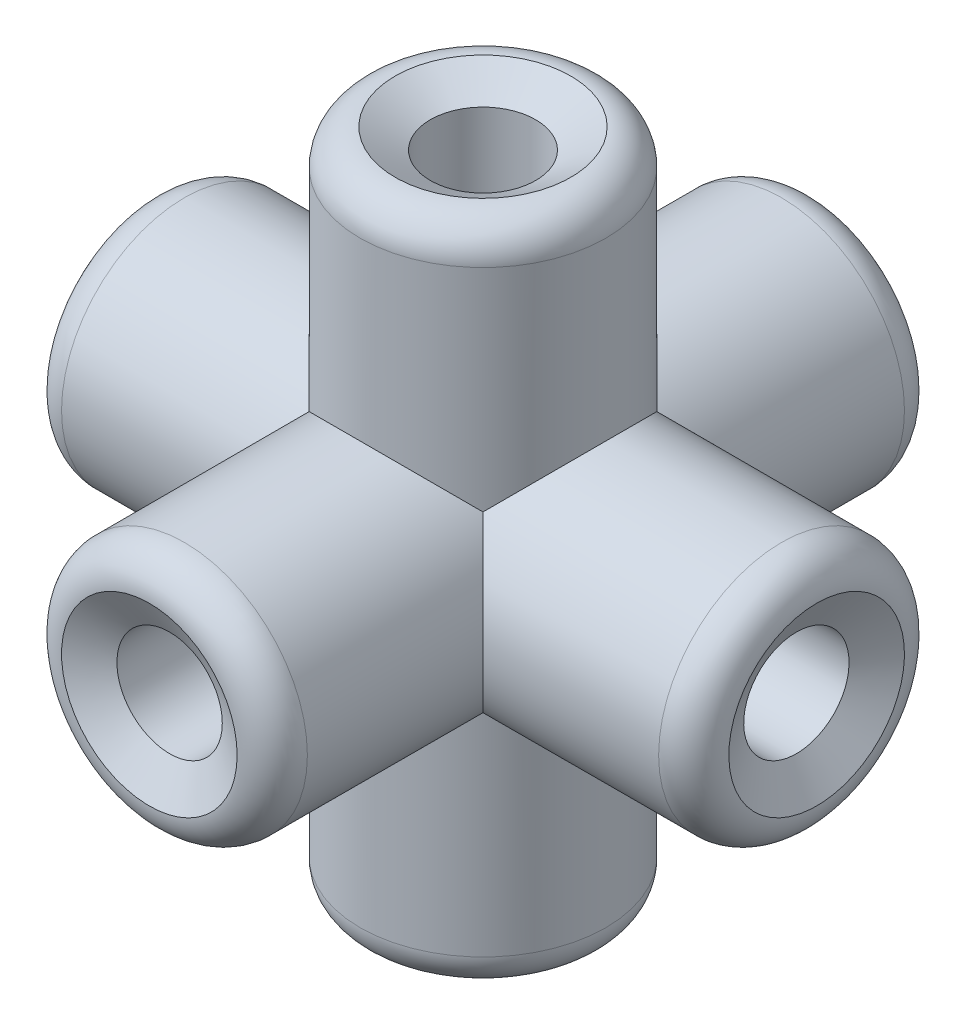
ISO-10303-21;
HEADER;
FILE_DESCRIPTION(('STEP AP214'),'2;1');
FILE_NAME('part.step','',(''),(''),'','','');
FILE_SCHEMA(('AUTOMOTIVE_DESIGN { 1 0 10303 214 1 1 1 1 }'));
ENDSEC;
DATA;
#1=APPLICATION_CONTEXT('core data for automotive mechanical design processes');
#2=APPLICATION_PROTOCOL_DEFINITION('international standard','automotive_design',2000,#1);
#3=PRODUCT_CONTEXT('',#1,'mechanical');
#4=PRODUCT('Part','Part','',(#3));
#5=PRODUCT_RELATED_PRODUCT_CATEGORY('part','',(#4));
#6=PRODUCT_DEFINITION_FORMATION('','',#4);
#7=PRODUCT_DEFINITION_CONTEXT('part definition',#1,'design');
#8=PRODUCT_DEFINITION('design','',#6,#7);
#9=PRODUCT_DEFINITION_SHAPE('','',#8);
#10=(LENGTH_UNIT() NAMED_UNIT(*) SI_UNIT(.MILLI.,.METRE.));
#11=(NAMED_UNIT(*) PLANE_ANGLE_UNIT() SI_UNIT($,.RADIAN.));
#12=(NAMED_UNIT(*) SI_UNIT($,.STERADIAN.) SOLID_ANGLE_UNIT());
#13=UNCERTAINTY_MEASURE_WITH_UNIT(LENGTH_MEASURE(1.E-05),#10,'distance_accuracy_value','');
#14=(GEOMETRIC_REPRESENTATION_CONTEXT(3) GLOBAL_UNCERTAINTY_ASSIGNED_CONTEXT((#13)) GLOBAL_UNIT_ASSIGNED_CONTEXT((#10,
#11,#12)) REPRESENTATION_CONTEXT('',''));
#15=CARTESIAN_POINT('',(0.,0.,0.));
#16=DIRECTION('',(0.,0.,1.));
#17=DIRECTION('',(1.,0.,0.));
#18=AXIS2_PLACEMENT_3D('',#15,#16,#17);
#19=CARTESIAN_POINT('',(0.,0.,-9.21132486540519));
#20=DIRECTION('',(0.,0.,-1.));
#21=DIRECTION('',(-1.,0.,0.));
#22=AXIS2_PLACEMENT_3D('',#19,#20,#21);
#23=CONICAL_SURFACE('',#22,2.,1.0471975511966);
#24=CARTESIAN_POINT('',(0.,0.,-9.5));
#25=DIRECTION('',(0.,0.,1.));
#26=DIRECTION('',(1.,0.,0.));
#27=AXIS2_PLACEMENT_3D('',#24,#25,#26);
#28=CIRCLE('',#27,2.5);
#29=CARTESIAN_POINT('',(2.5,0.,-9.5));
#30=VERTEX_POINT('',#29);
#31=EDGE_CURVE('E11',#30,#30,#28,.T.);
#32=ORIENTED_EDGE('',*,*,#31,.F.);
#33=EDGE_LOOP('',(#32));
#34=FACE_BOUND('',#33,.T.);
#35=CARTESIAN_POINT('',(0.,0.,-8.92264973081037));
#36=DIRECTION('',(0.,0.,1.));
#37=DIRECTION('',(1.,0.,0.));
#38=AXIS2_PLACEMENT_3D('',#35,#36,#37);
#39=CIRCLE('',#38,1.5);
#40=CARTESIAN_POINT('',(1.5,0.,-8.92264973081037));
#41=VERTEX_POINT('',#40);
#42=EDGE_CURVE('E405',#41,#41,#39,.T.);
#43=ORIENTED_EDGE('',*,*,#42,.T.);
#44=EDGE_LOOP('',(#43));
#45=FACE_BOUND('',#44,.T.);
#46=ADVANCED_FACE('F16',(#34,#45),#23,.F.);
#47=CARTESIAN_POINT('',(0.,0.,-8.5));
#48=DIRECTION('',(0.,0.,1.));
#49=DIRECTION('',(1.,0.,0.));
#50=AXIS2_PLACEMENT_3D('',#47,#48,#49);
#51=TOROIDAL_SURFACE('',#50,2.5,1.);
#52=CARTESIAN_POINT('',(0.,0.,-8.5));
#53=DIRECTION('',(0.,0.,1.));
#54=DIRECTION('',(1.,0.,0.));
#55=AXIS2_PLACEMENT_3D('',#52,#53,#54);
#56=CIRCLE('',#55,3.5);
#57=CARTESIAN_POINT('',(3.5,0.,-8.5));
#58=VERTEX_POINT('',#57);
#59=EDGE_CURVE('E234',#58,#58,#56,.T.);
#60=ORIENTED_EDGE('',*,*,#59,.F.);
#61=EDGE_LOOP('',(#60));
#62=FACE_BOUND('',#61,.T.);
#63=ORIENTED_EDGE('',*,*,#31,.T.);
#64=EDGE_LOOP('',(#63));
#65=FACE_BOUND('',#64,.T.);
#66=ADVANCED_FACE('F444',(#62,#65),#51,.T.);
#67=CARTESIAN_POINT('',(0.,0.,3.5));
#68=DIRECTION('',(0.,0.,1.));
#69=DIRECTION('',(1.,0.,0.));
#70=AXIS2_PLACEMENT_3D('',#67,#68,#69);
#71=PLANE('',#70);
#72=CARTESIAN_POINT('',(0.,0.,3.5));
#73=DIRECTION('',(0.,0.,1.));
#74=DIRECTION('',(1.,0.,0.));
#75=AXIS2_PLACEMENT_3D('',#72,#73,#74);
#76=CIRCLE('',#75,1.5);
#77=CARTESIAN_POINT('',(1.5,0.,3.5));
#78=VERTEX_POINT('',#77);
#79=EDGE_CURVE('E27',#78,#78,#76,.T.);
#80=ORIENTED_EDGE('',*,*,#79,.T.);
#81=EDGE_LOOP('',(#80));
#82=FACE_BOUND('',#81,.T.);
#83=ADVANCED_FACE('F450',(#82),#71,.T.);
#84=CARTESIAN_POINT('',(0.,-3.5,0.));
#85=DIRECTION('',(0.,1.,0.));
#86=DIRECTION('',(0.,0.,-1.));
#87=AXIS2_PLACEMENT_3D('',#84,#85,#86);
#88=PLANE('',#87);
#89=CARTESIAN_POINT('',(0.,-3.5,0.));
#90=DIRECTION('',(0.,1.,0.));
#91=DIRECTION('',(-1.,0.,0.));
#92=AXIS2_PLACEMENT_3D('',#89,#90,#91);
#93=CIRCLE('',#92,1.5);
#94=CARTESIAN_POINT('',(-1.5,-3.5,0.));
#95=VERTEX_POINT('',#94);
#96=EDGE_CURVE('E221',#95,#95,#93,.T.);
#97=ORIENTED_EDGE('',*,*,#96,.F.);
#98=EDGE_LOOP('',(#97));
#99=FACE_BOUND('',#98,.T.);
#100=ADVANCED_FACE('F500',(#99),#88,.F.);
#101=CARTESIAN_POINT('',(3.5,0.,0.));
#102=DIRECTION('',(1.,0.,0.));
#103=DIRECTION('',(0.,0.,-1.));
#104=AXIS2_PLACEMENT_3D('',#101,#102,#103);
#105=PLANE('',#104);
#106=CARTESIAN_POINT('',(3.5,0.,0.));
#107=DIRECTION('',(1.,0.,0.));
#108=DIRECTION('',(0.,1.,0.));
#109=AXIS2_PLACEMENT_3D('',#106,#107,#108);
#110=CIRCLE('',#109,1.5);
#111=CARTESIAN_POINT('',(3.5,1.5,0.));
#112=VERTEX_POINT('',#111);
#113=EDGE_CURVE('E297',#112,#112,#110,.T.);
#114=ORIENTED_EDGE('',*,*,#113,.T.);
#115=EDGE_LOOP('',(#114));
#116=FACE_BOUND('',#115,.T.);
#117=ADVANCED_FACE('F503',(#116),#105,.T.);
#118=CARTESIAN_POINT('',(0.,3.5,0.));
#119=DIRECTION('',(0.,1.,0.));
#120=DIRECTION('',(0.,0.,-1.));
#121=AXIS2_PLACEMENT_3D('',#118,#119,#120);
#122=PLANE('',#121);
#123=CARTESIAN_POINT('',(0.,3.5,0.));
#124=DIRECTION('',(0.,1.,0.));
#125=DIRECTION('',(-1.,0.,0.));
#126=AXIS2_PLACEMENT_3D('',#123,#124,#125);
#127=CIRCLE('',#126,1.5);
#128=CARTESIAN_POINT('',(-1.5,3.5,0.));
#129=VERTEX_POINT('',#128);
#130=EDGE_CURVE('E291',#129,#129,#127,.T.);
#131=ORIENTED_EDGE('',*,*,#130,.T.);
#132=EDGE_LOOP('',(#131));
#133=FACE_BOUND('',#132,.T.);
#134=ADVANCED_FACE('F512',(#133),#122,.T.);
#135=CARTESIAN_POINT('',(-3.5,0.,0.));
#136=DIRECTION('',(1.,0.,0.));
#137=DIRECTION('',(0.,0.,1.));
#138=AXIS2_PLACEMENT_3D('',#135,#136,#137);
#139=PLANE('',#138);
#140=CARTESIAN_POINT('',(-3.5,0.,0.));
#141=DIRECTION('',(1.,0.,0.));
#142=DIRECTION('',(0.,1.,0.));
#143=AXIS2_PLACEMENT_3D('',#140,#141,#142);
#144=CIRCLE('',#143,1.5);
#145=CARTESIAN_POINT('',(-3.5,1.5,0.));
#146=VERTEX_POINT('',#145);
#147=EDGE_CURVE('E287',#146,#146,#144,.T.);
#148=ORIENTED_EDGE('',*,*,#147,.F.);
#149=EDGE_LOOP('',(#148));
#150=FACE_BOUND('',#149,.T.);
#151=ADVANCED_FACE('F509',(#150),#139,.F.);
#152=CARTESIAN_POINT('',(0.,0.,3.5));
#153=DIRECTION('',(0.,0.,1.));
#154=DIRECTION('',(1.,0.,0.));
#155=AXIS2_PLACEMENT_3D('',#152,#153,#154);
#156=CYLINDRICAL_SURFACE('',#155,1.5);
#157=CARTESIAN_POINT('',(0.,0.,8.92264973081037));
#158=DIRECTION('',(0.,0.,-1.));
#159=DIRECTION('',(1.,0.,0.));
#160=AXIS2_PLACEMENT_3D('',#157,#158,#159);
#161=CIRCLE('',#160,1.5);
#162=CARTESIAN_POINT('',(1.5,0.,8.92264973081037));
#163=VERTEX_POINT('',#162);
#164=EDGE_CURVE('E257',#163,#163,#161,.T.);
#165=ORIENTED_EDGE('',*,*,#164,.F.);
#166=EDGE_LOOP('',(#165));
#167=FACE_BOUND('',#166,.T.);
#168=ORIENTED_EDGE('',*,*,#79,.F.);
#169=EDGE_LOOP('',(#168));
#170=FACE_BOUND('',#169,.T.);
#171=ADVANCED_FACE('F456',(#167,#170),#156,.F.);
#172=CARTESIAN_POINT('',(0.,-3.5,0.));
#173=DIRECTION('',(0.,1.,0.));
#174=DIRECTION('',(-1.,0.,0.));
#175=AXIS2_PLACEMENT_3D('',#172,#173,#174);
#176=CYLINDRICAL_SURFACE('',#175,1.5);
#177=ORIENTED_EDGE('',*,*,#96,.T.);
#178=EDGE_LOOP('',(#177));
#179=FACE_BOUND('',#178,.T.);
#180=CARTESIAN_POINT('',(0.,-8.92264973081037,0.));
#181=DIRECTION('',(0.,1.,0.));
#182=DIRECTION('',(-1.,0.,0.));
#183=AXIS2_PLACEMENT_3D('',#180,#181,#182);
#184=CIRCLE('',#183,1.5);
#185=CARTESIAN_POINT('',(-1.5,-8.92264973081037,0.));
#186=VERTEX_POINT('',#185);
#187=EDGE_CURVE('E254',#186,#186,#184,.T.);
#188=ORIENTED_EDGE('',*,*,#187,.F.);
#189=EDGE_LOOP('',(#188));
#190=FACE_BOUND('',#189,.T.);
#191=ADVANCED_FACE('F505',(#179,#190),#176,.F.);
#192=CARTESIAN_POINT('',(3.5,0.,0.));
#193=DIRECTION('',(1.,0.,0.));
#194=DIRECTION('',(0.,1.,0.));
#195=AXIS2_PLACEMENT_3D('',#192,#193,#194);
#196=CYLINDRICAL_SURFACE('',#195,1.5);
#197=CARTESIAN_POINT('',(8.92264973081037,0.,0.));
#198=DIRECTION('',(-1.,0.,0.));
#199=DIRECTION('',(0.,1.,0.));
#200=AXIS2_PLACEMENT_3D('',#197,#198,#199);
#201=CIRCLE('',#200,1.5);
#202=CARTESIAN_POINT('',(8.92264973081037,1.5,0.));
#203=VERTEX_POINT('',#202);
#204=EDGE_CURVE('E258',#203,#203,#201,.T.);
#205=ORIENTED_EDGE('',*,*,#204,.F.);
#206=EDGE_LOOP('',(#205));
#207=FACE_BOUND('',#206,.T.);
#208=ORIENTED_EDGE('',*,*,#113,.F.);
#209=EDGE_LOOP('',(#208));
#210=FACE_BOUND('',#209,.T.);
#211=ADVANCED_FACE('F475',(#207,#210),#196,.F.);
#212=CARTESIAN_POINT('',(0.,3.5,0.));
#213=DIRECTION('',(0.,1.,0.));
#214=DIRECTION('',(-1.,0.,0.));
#215=AXIS2_PLACEMENT_3D('',#212,#213,#214);
#216=CYLINDRICAL_SURFACE('',#215,1.5);
#217=CARTESIAN_POINT('',(0.,8.92264973081037,0.));
#218=DIRECTION('',(0.,-1.,0.));
#219=DIRECTION('',(-1.,0.,0.));
#220=AXIS2_PLACEMENT_3D('',#217,#218,#219);
#221=CIRCLE('',#220,1.5);
#222=CARTESIAN_POINT('',(-1.5,8.92264973081037,0.));
#223=VERTEX_POINT('',#222);
#224=EDGE_CURVE('E253',#223,#223,#221,.T.);
#225=ORIENTED_EDGE('',*,*,#224,.F.);
#226=EDGE_LOOP('',(#225));
#227=FACE_BOUND('',#226,.T.);
#228=ORIENTED_EDGE('',*,*,#130,.F.);
#229=EDGE_LOOP('',(#228));
#230=FACE_BOUND('',#229,.T.);
#231=ADVANCED_FACE('F466',(#227,#230),#216,.F.);
#232=CARTESIAN_POINT('',(-3.5,0.,0.));
#233=DIRECTION('',(1.,0.,0.));
#234=DIRECTION('',(0.,1.,0.));
#235=AXIS2_PLACEMENT_3D('',#232,#233,#234);
#236=CYLINDRICAL_SURFACE('',#235,1.5);
#237=ORIENTED_EDGE('',*,*,#147,.T.);
#238=EDGE_LOOP('',(#237));
#239=FACE_BOUND('',#238,.T.);
#240=CARTESIAN_POINT('',(-8.92264973081037,0.,0.));
#241=DIRECTION('',(1.,0.,0.));
#242=DIRECTION('',(0.,1.,0.));
#243=AXIS2_PLACEMENT_3D('',#240,#241,#242);
#244=CIRCLE('',#243,1.5);
#245=CARTESIAN_POINT('',(-8.92264973081037,1.5,0.));
#246=VERTEX_POINT('',#245);
#247=EDGE_CURVE('E241',#246,#246,#244,.T.);
#248=ORIENTED_EDGE('',*,*,#247,.F.);
#249=EDGE_LOOP('',(#248));
#250=FACE_BOUND('',#249,.T.);
#251=ADVANCED_FACE('F463',(#239,#250),#236,.F.);
#252=CARTESIAN_POINT('',(0.,0.,9.21132486540519));
#253=DIRECTION('',(0.,0.,1.));
#254=DIRECTION('',(1.,0.,0.));
#255=AXIS2_PLACEMENT_3D('',#252,#253,#254);
#256=CONICAL_SURFACE('',#255,2.,1.0471975511966);
#257=CARTESIAN_POINT('',(0.,0.,9.5));
#258=DIRECTION('',(0.,0.,1.));
#259=DIRECTION('',(1.,0.,0.));
#260=AXIS2_PLACEMENT_3D('',#257,#258,#259);
#261=CIRCLE('',#260,2.5);
#262=CARTESIAN_POINT('',(2.5,0.,9.5));
#263=VERTEX_POINT('',#262);
#264=EDGE_CURVE('E235',#263,#263,#261,.T.);
#265=ORIENTED_EDGE('',*,*,#264,.T.);
#266=EDGE_LOOP('',(#265));
#267=FACE_BOUND('',#266,.T.);
#268=ORIENTED_EDGE('',*,*,#164,.T.);
#269=EDGE_LOOP('',(#268));
#270=FACE_BOUND('',#269,.T.);
#271=ADVANCED_FACE('F465',(#267,#270),#256,.F.);
#272=CARTESIAN_POINT('',(0.,-9.21132486540519,0.));
#273=DIRECTION('',(0.,-1.,0.));
#274=DIRECTION('',(1.,0.,0.));
#275=AXIS2_PLACEMENT_3D('',#272,#273,#274);
#276=CONICAL_SURFACE('',#275,2.,1.0471975511966);
#277=ORIENTED_EDGE('',*,*,#187,.T.);
#278=EDGE_LOOP('',(#277));
#279=FACE_BOUND('',#278,.T.);
#280=CARTESIAN_POINT('',(0.,-9.5,0.));
#281=DIRECTION('',(0.,1.,0.));
#282=DIRECTION('',(-1.,0.,0.));
#283=AXIS2_PLACEMENT_3D('',#280,#281,#282);
#284=CIRCLE('',#283,2.5);
#285=CARTESIAN_POINT('',(-2.5,-9.5,0.));
#286=VERTEX_POINT('',#285);
#287=EDGE_CURVE('E242',#286,#286,#284,.T.);
#288=ORIENTED_EDGE('',*,*,#287,.F.);
#289=EDGE_LOOP('',(#288));
#290=FACE_BOUND('',#289,.T.);
#291=ADVANCED_FACE('F472',(#279,#290),#276,.F.);
#292=CARTESIAN_POINT('',(9.21132486540519,0.,0.));
#293=DIRECTION('',(1.,0.,0.));
#294=DIRECTION('',(0.,1.,0.));
#295=AXIS2_PLACEMENT_3D('',#292,#293,#294);
#296=CONICAL_SURFACE('',#295,2.,1.0471975511966);
#297=CARTESIAN_POINT('',(9.5,0.,0.));
#298=DIRECTION('',(1.,0.,0.));
#299=DIRECTION('',(0.,1.,0.));
#300=AXIS2_PLACEMENT_3D('',#297,#298,#299);
#301=CIRCLE('',#300,2.5);
#302=CARTESIAN_POINT('',(9.5,2.5,0.));
#303=VERTEX_POINT('',#302);
#304=EDGE_CURVE('E250',#303,#303,#301,.T.);
#305=ORIENTED_EDGE('',*,*,#304,.T.);
#306=EDGE_LOOP('',(#305));
#307=FACE_BOUND('',#306,.T.);
#308=ORIENTED_EDGE('',*,*,#204,.T.);
#309=EDGE_LOOP('',(#308));
#310=FACE_BOUND('',#309,.T.);
#311=ADVANCED_FACE('F416',(#307,#310),#296,.F.);
#312=CARTESIAN_POINT('',(0.,9.21132486540519,0.));
#313=DIRECTION('',(0.,1.,0.));
#314=DIRECTION('',(-1.,0.,0.));
#315=AXIS2_PLACEMENT_3D('',#312,#313,#314);
#316=CONICAL_SURFACE('',#315,2.,1.0471975511966);
#317=ORIENTED_EDGE('',*,*,#224,.T.);
#318=EDGE_LOOP('',(#317));
#319=FACE_BOUND('',#318,.T.);
#320=CARTESIAN_POINT('',(0.,9.5,0.));
#321=DIRECTION('',(0.,1.,0.));
#322=DIRECTION('',(-1.,0.,0.));
#323=AXIS2_PLACEMENT_3D('',#320,#321,#322);
#324=CIRCLE('',#323,2.5);
#325=CARTESIAN_POINT('',(-2.5,9.5,0.));
#326=VERTEX_POINT('',#325);
#327=EDGE_CURVE('E246',#326,#326,#324,.T.);
#328=ORIENTED_EDGE('',*,*,#327,.T.);
#329=EDGE_LOOP('',(#328));
#330=FACE_BOUND('',#329,.T.);
#331=ADVANCED_FACE('F486',(#319,#330),#316,.F.);
#332=CARTESIAN_POINT('',(-9.21132486540519,0.,0.));
#333=DIRECTION('',(-1.,0.,0.));
#334=DIRECTION('',(0.,-1.,0.));
#335=AXIS2_PLACEMENT_3D('',#332,#333,#334);
#336=CONICAL_SURFACE('',#335,2.,1.0471975511966);
#337=ORIENTED_EDGE('',*,*,#247,.T.);
#338=EDGE_LOOP('',(#337));
#339=FACE_BOUND('',#338,.T.);
#340=CARTESIAN_POINT('',(-9.5,0.,0.));
#341=DIRECTION('',(1.,0.,0.));
#342=DIRECTION('',(0.,1.,0.));
#343=AXIS2_PLACEMENT_3D('',#340,#341,#342);
#344=CIRCLE('',#343,2.5);
#345=CARTESIAN_POINT('',(-9.5,2.5,0.));
#346=VERTEX_POINT('',#345);
#347=EDGE_CURVE('E243',#346,#346,#344,.T.);
#348=ORIENTED_EDGE('',*,*,#347,.F.);
#349=EDGE_LOOP('',(#348));
#350=FACE_BOUND('',#349,.T.);
#351=ADVANCED_FACE('F482',(#339,#350),#336,.F.);
#352=CARTESIAN_POINT('',(0.,0.,8.5));
#353=DIRECTION('',(0.,0.,1.));
#354=DIRECTION('',(1.,0.,0.));
#355=AXIS2_PLACEMENT_3D('',#352,#353,#354);
#356=TOROIDAL_SURFACE('',#355,2.5,1.);
#357=CARTESIAN_POINT('',(0.,0.,8.5));
#358=DIRECTION('',(0.,0.,1.));
#359=DIRECTION('',(1.,0.,0.));
#360=AXIS2_PLACEMENT_3D('',#357,#358,#359);
#361=CIRCLE('',#360,3.5);
#362=CARTESIAN_POINT('',(3.5,0.,8.5));
#363=VERTEX_POINT('',#362);
#364=EDGE_CURVE('E247',#363,#363,#361,.T.);
#365=ORIENTED_EDGE('',*,*,#364,.T.);
#366=EDGE_LOOP('',(#365));
#367=FACE_BOUND('',#366,.T.);
#368=ORIENTED_EDGE('',*,*,#264,.F.);
#369=EDGE_LOOP('',(#368));
#370=FACE_BOUND('',#369,.T.);
#371=ADVANCED_FACE('F485',(#367,#370),#356,.T.);
#372=CARTESIAN_POINT('',(0.,-8.5,0.));
#373=DIRECTION('',(0.,1.,0.));
#374=DIRECTION('',(-1.,0.,0.));
#375=AXIS2_PLACEMENT_3D('',#372,#373,#374);
#376=TOROIDAL_SURFACE('',#375,2.5,1.);
#377=ORIENTED_EDGE('',*,*,#287,.T.);
#378=EDGE_LOOP('',(#377));
#379=FACE_BOUND('',#378,.T.);
#380=CARTESIAN_POINT('',(0.,-8.5,0.));
#381=DIRECTION('',(0.,1.,0.));
#382=DIRECTION('',(-1.,0.,0.));
#383=AXIS2_PLACEMENT_3D('',#380,#381,#382);
#384=CIRCLE('',#383,3.5);
#385=CARTESIAN_POINT('',(-3.5,-8.5,0.));
#386=VERTEX_POINT('',#385);
#387=EDGE_CURVE('E321',#386,#386,#384,.T.);
#388=ORIENTED_EDGE('',*,*,#387,.F.);
#389=EDGE_LOOP('',(#388));
#390=FACE_BOUND('',#389,.T.);
#391=ADVANCED_FACE('F423',(#379,#390),#376,.T.);
#392=CARTESIAN_POINT('',(8.5,0.,0.));
#393=DIRECTION('',(1.,0.,0.));
#394=DIRECTION('',(0.,1.,0.));
#395=AXIS2_PLACEMENT_3D('',#392,#393,#394);
#396=TOROIDAL_SURFACE('',#395,2.5,1.);
#397=ORIENTED_EDGE('',*,*,#304,.F.);
#398=EDGE_LOOP('',(#397));
#399=FACE_BOUND('',#398,.T.);
#400=CARTESIAN_POINT('',(8.5,0.,0.));
#401=DIRECTION('',(1.,0.,0.));
#402=DIRECTION('',(0.,1.,0.));
#403=AXIS2_PLACEMENT_3D('',#400,#401,#402);
#404=CIRCLE('',#403,3.5);
#405=CARTESIAN_POINT('',(8.5,3.5,0.));
#406=VERTEX_POINT('',#405);
#407=EDGE_CURVE('E312',#406,#406,#404,.T.);
#408=ORIENTED_EDGE('',*,*,#407,.T.);
#409=EDGE_LOOP('',(#408));
#410=FACE_BOUND('',#409,.T.);
#411=ADVANCED_FACE('F419',(#399,#410),#396,.T.);
#412=CARTESIAN_POINT('',(0.,8.5,0.));
#413=DIRECTION('',(0.,1.,0.));
#414=DIRECTION('',(-1.,0.,0.));
#415=AXIS2_PLACEMENT_3D('',#412,#413,#414);
#416=TOROIDAL_SURFACE('',#415,2.5,1.);
#417=ORIENTED_EDGE('',*,*,#327,.F.);
#418=EDGE_LOOP('',(#417));
#419=FACE_BOUND('',#418,.T.);
#420=CARTESIAN_POINT('',(0.,8.5,0.));
#421=DIRECTION('',(0.,1.,0.));
#422=DIRECTION('',(-1.,0.,0.));
#423=AXIS2_PLACEMENT_3D('',#420,#421,#422);
#424=CIRCLE('',#423,3.5);
#425=CARTESIAN_POINT('',(-3.5,8.5,0.));
#426=VERTEX_POINT('',#425);
#427=EDGE_CURVE('E223',#426,#426,#424,.T.);
#428=ORIENTED_EDGE('',*,*,#427,.T.);
#429=EDGE_LOOP('',(#428));
#430=FACE_BOUND('',#429,.T.);
#431=ADVANCED_FACE('F422',(#419,#430),#416,.T.);
#432=CARTESIAN_POINT('',(-8.5,0.,0.));
#433=DIRECTION('',(1.,0.,0.));
#434=DIRECTION('',(0.,1.,0.));
#435=AXIS2_PLACEMENT_3D('',#432,#433,#434);
#436=TOROIDAL_SURFACE('',#435,2.5,1.);
#437=CARTESIAN_POINT('',(-8.5,0.,0.));
#438=DIRECTION('',(1.,0.,0.));
#439=DIRECTION('',(0.,1.,0.));
#440=AXIS2_PLACEMENT_3D('',#437,#438,#439);
#441=CIRCLE('',#440,3.5);
#442=CARTESIAN_POINT('',(-8.5,3.5,0.));
#443=VERTEX_POINT('',#442);
#444=EDGE_CURVE('E265',#443,#443,#441,.T.);
#445=ORIENTED_EDGE('',*,*,#444,.F.);
#446=EDGE_LOOP('',(#445));
#447=FACE_BOUND('',#446,.T.);
#448=ORIENTED_EDGE('',*,*,#347,.T.);
#449=EDGE_LOOP('',(#448));
#450=FACE_BOUND('',#449,.T.);
#451=ADVANCED_FACE('F460',(#447,#450),#436,.T.);
#452=CARTESIAN_POINT('',(0.,0.,0.));
#453=DIRECTION('',(0.,0.,1.));
#454=DIRECTION('',(1.,0.,0.));
#455=AXIS2_PLACEMENT_3D('',#452,#453,#454);
#456=CYLINDRICAL_SURFACE('',#455,3.5);
#457=CARTESIAN_POINT('',(3.5,0.,3.5));
#458=CARTESIAN_POINT('',(3.5,0.940663857242918,3.5));
#459=CARTESIAN_POINT('',(3.14002352640281,1.80972394192042,3.14002352640281));
#460=CARTESIAN_POINT('',(2.47487373412055,2.47487373418528,2.47487373412055));
#461=(BOUNDED_CURVE() B_SPLINE_CURVE(3,(#457,#458,#459,#460),.UNSPECIFIED.,.F.,
.F.) B_SPLINE_CURVE_WITH_KNOTS((4,4),(-1.,0.),
.UNSPECIFIED.) CURVE() GEOMETRIC_REPRESENTATION_ITEM() RATIONAL_B_SPLINE_CURVE((1.,
0.949253021672523,0.949253021672523,1.)) REPRESENTATION_ITEM(''));
#462=CARTESIAN_POINT('',(3.5,0.,3.5));
#463=VERTEX_POINT('',#462);
#464=CARTESIAN_POINT('',(2.47487373415292,2.47487373415292,2.47487373415292));
#465=VERTEX_POINT('',#464);
#466=EDGE_CURVE('E346',#463,#465,#461,.T.);
#467=ORIENTED_EDGE('',*,*,#466,.T.);
#468=CARTESIAN_POINT('',(2.47487373415291,2.47487373415292,2.47487373415292));
#469=CARTESIAN_POINT('',(1.02512626583136,3.92462120247447,3.92462120247447));
#470=CARTESIAN_POINT('',(-1.02512626588504,3.92462120246045,3.92462120246045));
#471=CARTESIAN_POINT('',(-2.47487373418677,2.47487373411907,2.47487373411907));
#472=(BOUNDED_CURVE() B_SPLINE_CURVE(3,(#468,#469,#470,#471),.UNSPECIFIED.,.F.,
.F.) B_SPLINE_CURVE_WITH_KNOTS((4,4),(-1.,0.),
.UNSPECIFIED.) CURVE() GEOMETRIC_REPRESENTATION_ITEM() RATIONAL_B_SPLINE_CURVE((1.,
0.804737854121141,0.804737854121141,1.)) REPRESENTATION_ITEM(''));
#473=CARTESIAN_POINT('',(-2.47487373415292,2.47487373415292,2.47487373415292));
#474=VERTEX_POINT('',#473);
#475=EDGE_CURVE('E302',#465,#474,#472,.T.);
#476=ORIENTED_EDGE('',*,*,#475,.T.);
#477=CARTESIAN_POINT('',(-2.47487373415292,2.47487373415292,2.47487373415292));
#478=CARTESIAN_POINT('',(-3.92462120245875,1.02512626584708,3.92462120245875));
#479=CARTESIAN_POINT('',(-3.92462120245875,-1.02512626584708,3.92462120245875));
#480=CARTESIAN_POINT('',(-2.47487373415292,-2.47487373415292,2.47487373415292));
#481=(BOUNDED_CURVE() B_SPLINE_CURVE(3,(#477,#478,#479,#480),.UNSPECIFIED.,.F.,
.F.) B_SPLINE_CURVE_WITH_KNOTS((4,4),(0.,1.),
.UNSPECIFIED.) CURVE() GEOMETRIC_REPRESENTATION_ITEM() RATIONAL_B_SPLINE_CURVE((1.,
0.804737854124365,0.804737854124365,1.)) REPRESENTATION_ITEM(''));
#482=CARTESIAN_POINT('',(-2.47487373415292,-2.47487373415292,2.47487373415292));
#483=VERTEX_POINT('',#482);
#484=EDGE_CURVE('E229',#474,#483,#481,.T.);
#485=ORIENTED_EDGE('',*,*,#484,.T.);
#486=CARTESIAN_POINT('',(-2.47487373565571,-2.47487373265012,2.47487373265012));
#487=CARTESIAN_POINT('',(-1.0251262675322,-3.92462120253427,3.92462120253427));
#488=CARTESIAN_POINT('',(1.02512626514909,-3.92462120315675,3.92462120315675));
#489=CARTESIAN_POINT('',(2.47487373415292,-2.47487373415292,2.47487373415292));
#490=(BOUNDED_CURVE() B_SPLINE_CURVE(3,(#486,#487,#488,#489),.UNSPECIFIED.,.F.,
.F.) B_SPLINE_CURVE_WITH_KNOTS((4,4),(0.,1.),
.UNSPECIFIED.) CURVE() GEOMETRIC_REPRESENTATION_ITEM() RATIONAL_B_SPLINE_CURVE((1.,
0.804737853981242,0.804737853981242,1.)) REPRESENTATION_ITEM(''));
#491=CARTESIAN_POINT('',(2.47487373415291,-2.47487373415291,2.47487373415292));
#492=VERTEX_POINT('',#491);
#493=EDGE_CURVE('E391',#483,#492,#490,.T.);
#494=ORIENTED_EDGE('',*,*,#493,.T.);
#495=CARTESIAN_POINT('',(2.47487373401354,-2.47487373429229,2.47487373401354));
#496=CARTESIAN_POINT('',(3.14002352636314,-1.8097239420176,3.14002352636314));
#497=CARTESIAN_POINT('',(3.5,-0.940663857297481,3.5));
#498=CARTESIAN_POINT('',(3.5,0.,3.5));
#499=(BOUNDED_CURVE() B_SPLINE_CURVE(3,(#495,#496,#497,#498),.UNSPECIFIED.,.F.,
.F.) B_SPLINE_CURVE_WITH_KNOTS((4,4),(-1.,0.),
.UNSPECIFIED.) CURVE() GEOMETRIC_REPRESENTATION_ITEM() RATIONAL_B_SPLINE_CURVE((1.,
0.949253021667008,0.949253021667008,1.)) REPRESENTATION_ITEM(''));
#500=EDGE_CURVE('E322',#492,#463,#499,.T.);
#501=ORIENTED_EDGE('',*,*,#500,.T.);
#502=EDGE_LOOP('',(#467,#476,#485,#494,#501));
#503=FACE_BOUND('',#502,.T.);
#504=ORIENTED_EDGE('',*,*,#364,.F.);
#505=EDGE_LOOP('',(#504));
#506=FACE_BOUND('',#505,.T.);
#507=ADVANCED_FACE('F438',(#503,#506),#456,.T.);
#508=CARTESIAN_POINT('',(0.,-9.5,0.));
#509=DIRECTION('',(0.,1.,0.));
#510=DIRECTION('',(-1.,0.,0.));
#511=AXIS2_PLACEMENT_3D('',#508,#509,#510);
#512=CYLINDRICAL_SURFACE('',#511,3.5);
#513=ORIENTED_EDGE('',*,*,#493,.F.);
#514=CARTESIAN_POINT('',(-3.5,-3.5,0.));
#515=CARTESIAN_POINT('',(-3.5,-3.5,0.940663857226416));
#516=CARTESIAN_POINT('',(-3.14002352641481,-3.14002352641481,1.80972394189102));
#517=CARTESIAN_POINT('',(-2.47487373415292,-2.47487373415292,2.47487373415291));
#518=(BOUNDED_CURVE() B_SPLINE_CURVE(3,(#514,#515,#516,#517),.UNSPECIFIED.,.F.,
.F.) B_SPLINE_CURVE_WITH_KNOTS((4,4),(0.,1.),
.UNSPECIFIED.) CURVE() GEOMETRIC_REPRESENTATION_ITEM() RATIONAL_B_SPLINE_CURVE((1.,
0.949253021674191,0.949253021674191,1.)) REPRESENTATION_ITEM(''));
#519=CARTESIAN_POINT('',(-3.5,-3.5,0.));
#520=VERTEX_POINT('',#519);
#521=EDGE_CURVE('E266',#520,#483,#518,.T.);
#522=ORIENTED_EDGE('',*,*,#521,.F.);
#523=CARTESIAN_POINT('',(-2.47487373415291,-2.47487373415291,-2.47487373415292));
#524=CARTESIAN_POINT('',(-3.14002352641481,-3.14002352641481,-1.80972394189102));
#525=CARTESIAN_POINT('',(-3.5,-3.5,-0.940663857226419));
#526=CARTESIAN_POINT('',(-3.5,-3.5,0.));
#527=(BOUNDED_CURVE() B_SPLINE_CURVE(3,(#523,#524,#525,#526),.UNSPECIFIED.,.F.,
.F.) B_SPLINE_CURVE_WITH_KNOTS((4,4),(0.,1.),
.UNSPECIFIED.) CURVE() GEOMETRIC_REPRESENTATION_ITEM() RATIONAL_B_SPLINE_CURVE((1.,
0.949253021674191,0.949253021674191,1.)) REPRESENTATION_ITEM(''));
#528=CARTESIAN_POINT('',(-2.47487373415292,-2.47487373415292,-2.47487373415292));
#529=VERTEX_POINT('',#528);
#530=EDGE_CURVE('E191',#529,#520,#527,.T.);
#531=ORIENTED_EDGE('',*,*,#530,.F.);
#532=CARTESIAN_POINT('',(2.47487373415292,-2.47487373415292,-2.47487373415292));
#533=CARTESIAN_POINT('',(1.02512626578374,-3.92462120252209,-3.92462120252209));
#534=CARTESIAN_POINT('',(-1.025126266,-3.9246212024656,-3.9246212024656));
#535=CARTESIAN_POINT('',(-2.47487373428929,-2.47487373401655,-2.47487373401655));
#536=(BOUNDED_CURVE() B_SPLINE_CURVE(3,(#532,#533,#534,#535),.UNSPECIFIED.,.F.,
.F.) B_SPLINE_CURVE_WITH_KNOTS((4,4),(0.,1.),
.UNSPECIFIED.) CURVE() GEOMETRIC_REPRESENTATION_ITEM() RATIONAL_B_SPLINE_CURVE((1.,
0.804737854111377,0.804737854111377,1.)) REPRESENTATION_ITEM(''));
#537=CARTESIAN_POINT('',(2.47487373415292,-2.47487373415292,-2.47487373415292));
#538=VERTEX_POINT('',#537);
#539=EDGE_CURVE('E208',#538,#529,#536,.T.);
#540=ORIENTED_EDGE('',*,*,#539,.F.);
#541=CARTESIAN_POINT('',(2.47487373415291,-2.47487373415291,2.47487373415292));
#542=CARTESIAN_POINT('',(3.92462120245875,-3.92462120245875,1.02512626584709));
#543=CARTESIAN_POINT('',(3.92462120245875,-3.92462120245875,-1.02512626584708));
#544=CARTESIAN_POINT('',(2.47487373415292,-2.47487373415292,-2.47487373415292));
#545=(BOUNDED_CURVE() B_SPLINE_CURVE(3,(#541,#542,#543,#544),.UNSPECIFIED.,.F.,
.F.) B_SPLINE_CURVE_WITH_KNOTS((4,4),(0.,1.),
.UNSPECIFIED.) CURVE() GEOMETRIC_REPRESENTATION_ITEM() RATIONAL_B_SPLINE_CURVE((1.,
0.804737854124365,0.804737854124365,1.)) REPRESENTATION_ITEM(''));
#546=EDGE_CURVE('E313',#492,#538,#545,.T.);
#547=ORIENTED_EDGE('',*,*,#546,.F.);
#548=EDGE_LOOP('',(#513,#522,#531,#540,#547));
#549=FACE_BOUND('',#548,.T.);
#550=ORIENTED_EDGE('',*,*,#387,.T.);
#551=EDGE_LOOP('',(#550));
#552=FACE_BOUND('',#551,.T.);
#553=ADVANCED_FACE('F429',(#549,#552),#512,.T.);
#554=CARTESIAN_POINT('',(0.,0.,0.));
#555=DIRECTION('',(1.,0.,0.));
#556=DIRECTION('',(0.,1.,0.));
#557=AXIS2_PLACEMENT_3D('',#554,#555,#556);
#558=CYLINDRICAL_SURFACE('',#557,3.5);
#559=CARTESIAN_POINT('',(3.5,3.5,0.));
#560=CARTESIAN_POINT('',(3.5,3.5,0.940663857226419));
#561=CARTESIAN_POINT('',(3.14002352641481,3.14002352641481,1.80972394189102));
#562=CARTESIAN_POINT('',(2.47487373415292,2.47487373415292,2.47487373415292));
#563=(BOUNDED_CURVE() B_SPLINE_CURVE(3,(#559,#560,#561,#562),.UNSPECIFIED.,.F.,
.F.) B_SPLINE_CURVE_WITH_KNOTS((4,4),(-1.,0.),
.UNSPECIFIED.) CURVE() GEOMETRIC_REPRESENTATION_ITEM() RATIONAL_B_SPLINE_CURVE((1.,
0.949253021674191,0.949253021674191,1.)) REPRESENTATION_ITEM(''));
#564=CARTESIAN_POINT('',(3.5,3.5,0.));
#565=VERTEX_POINT('',#564);
#566=EDGE_CURVE('E303',#565,#465,#563,.T.);
#567=ORIENTED_EDGE('',*,*,#566,.T.);
#568=ORIENTED_EDGE('',*,*,#466,.F.);
#569=ORIENTED_EDGE('',*,*,#500,.F.);
#570=ORIENTED_EDGE('',*,*,#546,.T.);
#571=CARTESIAN_POINT('',(3.5,0.,-3.5));
#572=CARTESIAN_POINT('',(3.5,-0.940663857243192,-3.5));
#573=CARTESIAN_POINT('',(3.14002352640262,-1.8097239419209,-3.14002352640262));
#574=CARTESIAN_POINT('',(2.47487373412002,-2.47487373418581,-2.47487373412002));
#575=(BOUNDED_CURVE() B_SPLINE_CURVE(3,(#571,#572,#573,#574),.UNSPECIFIED.,.F.,
.F.) B_SPLINE_CURVE_WITH_KNOTS((4,4),(-1.,0.),
.UNSPECIFIED.) CURVE() GEOMETRIC_REPRESENTATION_ITEM() RATIONAL_B_SPLINE_CURVE((1.,
0.949253021672496,0.949253021672496,1.)) REPRESENTATION_ITEM(''));
#576=CARTESIAN_POINT('',(3.5,0.,-3.5));
#577=VERTEX_POINT('',#576);
#578=EDGE_CURVE('E215',#577,#538,#575,.T.);
#579=ORIENTED_EDGE('',*,*,#578,.F.);
#580=CARTESIAN_POINT('',(2.47487373415291,2.47487373415292,-2.47487373415292));
#581=CARTESIAN_POINT('',(3.14002352641481,1.80972394189102,-3.14002352641481));
#582=CARTESIAN_POINT('',(3.5,0.940663857226417,-3.5));
#583=CARTESIAN_POINT('',(3.5,0.,-3.5));
#584=(BOUNDED_CURVE() B_SPLINE_CURVE(3,(#580,#581,#582,#583),.UNSPECIFIED.,.F.,
.F.) B_SPLINE_CURVE_WITH_KNOTS((4,4),(-1.,0.),
.UNSPECIFIED.) CURVE() GEOMETRIC_REPRESENTATION_ITEM() RATIONAL_B_SPLINE_CURVE((1.,
0.949253021674191,0.949253021674191,1.)) REPRESENTATION_ITEM(''));
#585=CARTESIAN_POINT('',(2.47487373415292,2.47487373415292,-2.47487373415292));
#586=VERTEX_POINT('',#585);
#587=EDGE_CURVE('E202',#586,#577,#584,.T.);
#588=ORIENTED_EDGE('',*,*,#587,.F.);
#589=CARTESIAN_POINT('',(2.47487373415292,2.47487373415292,-2.47487373415292));
#590=CARTESIAN_POINT('',(3.14002352641481,3.14002352641481,-1.80972394189102));
#591=CARTESIAN_POINT('',(3.5,3.5,-0.940663857226417));
#592=CARTESIAN_POINT('',(3.5,3.5,0.));
#593=(BOUNDED_CURVE() B_SPLINE_CURVE(3,(#589,#590,#591,#592),.UNSPECIFIED.,.F.,
.F.) B_SPLINE_CURVE_WITH_KNOTS((4,4),(-1.,0.),
.UNSPECIFIED.) CURVE() GEOMETRIC_REPRESENTATION_ITEM() RATIONAL_B_SPLINE_CURVE((1.,
0.949253021674191,0.949253021674191,1.)) REPRESENTATION_ITEM(''));
#594=EDGE_CURVE('E198',#586,#565,#593,.T.);
#595=ORIENTED_EDGE('',*,*,#594,.T.);
#596=EDGE_LOOP('',(#567,#568,#569,#570,#579,#588,#595));
#597=FACE_BOUND('',#596,.T.);
#598=ORIENTED_EDGE('',*,*,#407,.F.);
#599=EDGE_LOOP('',(#598));
#600=FACE_BOUND('',#599,.T.);
#601=ADVANCED_FACE('F427',(#597,#600),#558,.T.);
#602=CARTESIAN_POINT('',(0.,-9.5,0.));
#603=DIRECTION('',(0.,1.,0.));
#604=DIRECTION('',(-1.,0.,0.));
#605=AXIS2_PLACEMENT_3D('',#602,#603,#604);
#606=CYLINDRICAL_SURFACE('',#605,3.5);
#607=ORIENTED_EDGE('',*,*,#594,.F.);
#608=CARTESIAN_POINT('',(-2.47487373415292,2.47487373415292,-2.47487373415292));
#609=CARTESIAN_POINT('',(-1.02512626583136,3.92462120247447,-3.92462120247447));
#610=CARTESIAN_POINT('',(1.02512626588504,3.92462120246045,-3.92462120246045));
#611=CARTESIAN_POINT('',(2.47487373418677,2.47487373411907,-2.47487373411907));
#612=(BOUNDED_CURVE() B_SPLINE_CURVE(3,(#608,#609,#610,#611),.UNSPECIFIED.,.F.,
.F.) B_SPLINE_CURVE_WITH_KNOTS((4,4),(-1.,0.),
.UNSPECIFIED.) CURVE() GEOMETRIC_REPRESENTATION_ITEM() RATIONAL_B_SPLINE_CURVE((1.,
0.804737854121141,0.804737854121141,1.)) REPRESENTATION_ITEM(''));
#613=CARTESIAN_POINT('',(-2.47487373415292,2.47487373415292,-2.47487373415292));
#614=VERTEX_POINT('',#613);
#615=EDGE_CURVE('E194',#614,#586,#612,.T.);
#616=ORIENTED_EDGE('',*,*,#615,.F.);
#617=CARTESIAN_POINT('',(-3.5,3.5,0.));
#618=CARTESIAN_POINT('',(-3.5,3.5,-0.940663857226416));
#619=CARTESIAN_POINT('',(-3.14002352641481,3.14002352641481,-1.80972394189102));
#620=CARTESIAN_POINT('',(-2.47487373415292,2.47487373415292,-2.47487373415291));
#621=(BOUNDED_CURVE() B_SPLINE_CURVE(3,(#617,#618,#619,#620),.UNSPECIFIED.,.F.,
.F.) B_SPLINE_CURVE_WITH_KNOTS((4,4),(-1.,0.),
.UNSPECIFIED.) CURVE() GEOMETRIC_REPRESENTATION_ITEM() RATIONAL_B_SPLINE_CURVE((1.,
0.949253021674191,0.949253021674191,1.)) REPRESENTATION_ITEM(''));
#622=CARTESIAN_POINT('',(-3.5,3.5,0.));
#623=VERTEX_POINT('',#622);
#624=EDGE_CURVE('E178',#623,#614,#621,.T.);
#625=ORIENTED_EDGE('',*,*,#624,.F.);
#626=CARTESIAN_POINT('',(-2.47487373415292,2.47487373415292,2.47487373415292));
#627=CARTESIAN_POINT('',(-3.14002352641481,3.14002352641481,1.80972394189102));
#628=CARTESIAN_POINT('',(-3.5,3.5,0.940663857226417));
#629=CARTESIAN_POINT('',(-3.5,3.5,0.));
#630=(BOUNDED_CURVE() B_SPLINE_CURVE(3,(#626,#627,#628,#629),.UNSPECIFIED.,.F.,
.F.) B_SPLINE_CURVE_WITH_KNOTS((4,4),(-1.,0.),
.UNSPECIFIED.) CURVE() GEOMETRIC_REPRESENTATION_ITEM() RATIONAL_B_SPLINE_CURVE((1.,
0.949253021674191,0.949253021674191,1.)) REPRESENTATION_ITEM(''));
#631=EDGE_CURVE('E188',#474,#623,#630,.T.);
#632=ORIENTED_EDGE('',*,*,#631,.F.);
#633=ORIENTED_EDGE('',*,*,#475,.F.);
#634=ORIENTED_EDGE('',*,*,#566,.F.);
#635=EDGE_LOOP('',(#607,#616,#625,#632,#633,#634));
#636=FACE_BOUND('',#635,.T.);
#637=ORIENTED_EDGE('',*,*,#427,.F.);
#638=EDGE_LOOP('',(#637));
#639=FACE_BOUND('',#638,.T.);
#640=ADVANCED_FACE('F195',(#636,#639),#606,.T.);
#641=CARTESIAN_POINT('',(0.,0.,0.));
#642=DIRECTION('',(1.,0.,0.));
#643=DIRECTION('',(0.,1.,0.));
#644=AXIS2_PLACEMENT_3D('',#641,#642,#643);
#645=CYLINDRICAL_SURFACE('',#644,3.5);
#646=ORIENTED_EDGE('',*,*,#631,.T.);
#647=ORIENTED_EDGE('',*,*,#624,.T.);
#648=CARTESIAN_POINT('',(-2.47487373415292,-2.47487373415292,-2.47487373415292));
#649=CARTESIAN_POINT('',(-3.92462120245875,-1.02512626584708,-3.92462120245875));
#650=CARTESIAN_POINT('',(-3.92462120245875,1.02512626584708,-3.92462120245875));
#651=CARTESIAN_POINT('',(-2.47487373415292,2.47487373415291,-2.47487373415292));
#652=(BOUNDED_CURVE() B_SPLINE_CURVE(3,(#648,#649,#650,#651),.UNSPECIFIED.,.F.,
.F.) B_SPLINE_CURVE_WITH_KNOTS((4,4),(0.,1.),
.UNSPECIFIED.) CURVE() GEOMETRIC_REPRESENTATION_ITEM() RATIONAL_B_SPLINE_CURVE((1.,
0.804737854124365,0.804737854124365,1.)) REPRESENTATION_ITEM(''));
#653=EDGE_CURVE('E184',#529,#614,#652,.T.);
#654=ORIENTED_EDGE('',*,*,#653,.F.);
#655=ORIENTED_EDGE('',*,*,#530,.T.);
#656=ORIENTED_EDGE('',*,*,#521,.T.);
#657=ORIENTED_EDGE('',*,*,#484,.F.);
#658=EDGE_LOOP('',(#646,#647,#654,#655,#656,#657));
#659=FACE_BOUND('',#658,.T.);
#660=ORIENTED_EDGE('',*,*,#444,.T.);
#661=EDGE_LOOP('',(#660));
#662=FACE_BOUND('',#661,.T.);
#663=ADVANCED_FACE('F180',(#659,#662),#645,.T.);
#664=CARTESIAN_POINT('',(0.,0.,-3.5));
#665=DIRECTION('',(0.,0.,1.));
#666=DIRECTION('',(1.,0.,0.));
#667=AXIS2_PLACEMENT_3D('',#664,#665,#666);
#668=PLANE('',#667);
#669=CARTESIAN_POINT('',(0.,0.,-3.5));
#670=DIRECTION('',(0.,0.,1.));
#671=DIRECTION('',(1.,0.,0.));
#672=AXIS2_PLACEMENT_3D('',#669,#670,#671);
#673=CIRCLE('',#672,1.5);
#674=CARTESIAN_POINT('',(1.5,0.,-3.5));
#675=VERTEX_POINT('',#674);
#676=EDGE_CURVE('E20',#675,#675,#673,.T.);
#677=ORIENTED_EDGE('',*,*,#676,.F.);
#678=EDGE_LOOP('',(#677));
#679=FACE_BOUND('',#678,.T.);
#680=ADVANCED_FACE('F18',(#679),#668,.F.);
#681=CARTESIAN_POINT('',(0.,0.,0.));
#682=DIRECTION('',(0.,0.,1.));
#683=DIRECTION('',(1.,0.,0.));
#684=AXIS2_PLACEMENT_3D('',#681,#682,#683);
#685=CYLINDRICAL_SURFACE('',#684,3.5);
#686=ORIENTED_EDGE('',*,*,#578,.T.);
#687=ORIENTED_EDGE('',*,*,#539,.T.);
#688=ORIENTED_EDGE('',*,*,#653,.T.);
#689=ORIENTED_EDGE('',*,*,#615,.T.);
#690=ORIENTED_EDGE('',*,*,#587,.T.);
#691=EDGE_LOOP('',(#686,#687,#688,#689,#690));
#692=FACE_BOUND('',#691,.T.);
#693=ORIENTED_EDGE('',*,*,#59,.T.);
#694=EDGE_LOOP('',(#693));
#695=FACE_BOUND('',#694,.T.);
#696=ADVANCED_FACE('F205',(#692,#695),#685,.T.);
#697=CARTESIAN_POINT('',(0.,0.,-3.5));
#698=DIRECTION('',(0.,0.,1.));
#699=DIRECTION('',(1.,0.,0.));
#700=AXIS2_PLACEMENT_3D('',#697,#698,#699);
#701=CYLINDRICAL_SURFACE('',#700,1.5);
#702=ORIENTED_EDGE('',*,*,#676,.T.);
#703=EDGE_LOOP('',(#702));
#704=FACE_BOUND('',#703,.T.);
#705=ORIENTED_EDGE('',*,*,#42,.F.);
#706=EDGE_LOOP('',(#705));
#707=FACE_BOUND('',#706,.T.);
#708=ADVANCED_FACE('F520',(#704,#707),#701,.F.);
#709=CLOSED_SHELL('',(#46,#66,#83,#100,#117,#134,#151,#171,#191,#211,#231,#251,#271,#291,#311,
#331,#351,#371,#391,#411,#431,#451,#507,#553,#601,#640,#663,#680,#696,#708));
#710=MANIFOLD_SOLID_BREP('B1',#709);
#711=ADVANCED_BREP_SHAPE_REPRESENTATION('',(#18,#710),#14);
#712=SHAPE_DEFINITION_REPRESENTATION(#9,#711);
ENDSEC;
END-ISO-10303-21;
